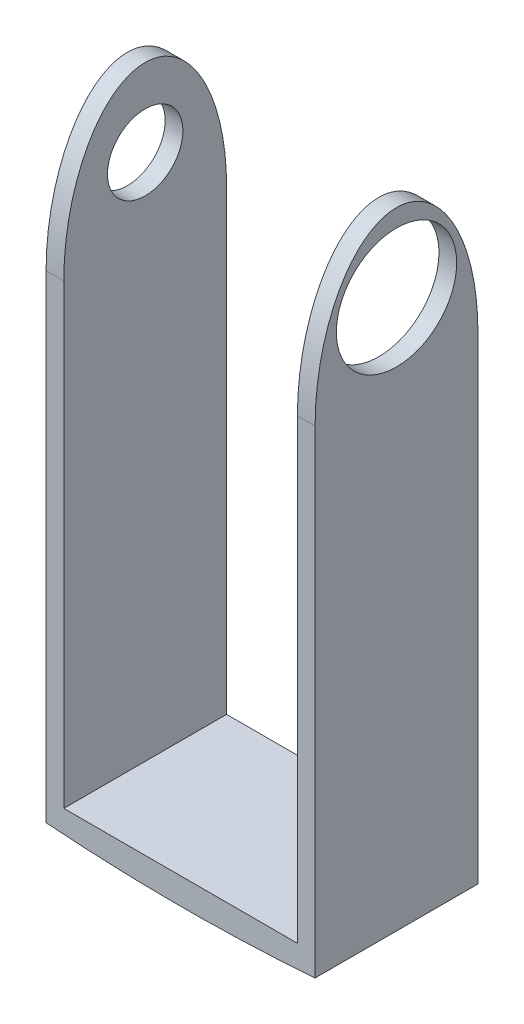
ISO-10303-21;
HEADER;
FILE_DESCRIPTION(('STEP AP214'),'2;1');
FILE_NAME('part.step','',(''),(''),'','','');
FILE_SCHEMA(('AUTOMOTIVE_DESIGN { 1 0 10303 214 1 1 1 1 }'));
ENDSEC;
DATA;
#1=APPLICATION_CONTEXT('core data for automotive mechanical design processes');
#2=APPLICATION_PROTOCOL_DEFINITION('international standard','automotive_design',2000,#1);
#3=PRODUCT_CONTEXT('',#1,'mechanical');
#4=PRODUCT('Part','Part','',(#3));
#5=PRODUCT_RELATED_PRODUCT_CATEGORY('part','',(#4));
#6=PRODUCT_DEFINITION_FORMATION('','',#4);
#7=PRODUCT_DEFINITION_CONTEXT('part definition',#1,'design');
#8=PRODUCT_DEFINITION('design','',#6,#7);
#9=PRODUCT_DEFINITION_SHAPE('','',#8);
#10=(LENGTH_UNIT() NAMED_UNIT(*) SI_UNIT(.MILLI.,.METRE.));
#11=(NAMED_UNIT(*) PLANE_ANGLE_UNIT() SI_UNIT($,.RADIAN.));
#12=(NAMED_UNIT(*) SI_UNIT($,.STERADIAN.) SOLID_ANGLE_UNIT());
#13=UNCERTAINTY_MEASURE_WITH_UNIT(LENGTH_MEASURE(1.E-05),#10,'distance_accuracy_value','');
#14=(GEOMETRIC_REPRESENTATION_CONTEXT(3) GLOBAL_UNCERTAINTY_ASSIGNED_CONTEXT((#13)) GLOBAL_UNIT_ASSIGNED_CONTEXT((#10,
#11,#12)) REPRESENTATION_CONTEXT('',''));
#15=CARTESIAN_POINT('',(0.,0.,0.));
#16=DIRECTION('',(0.,0.,1.));
#17=DIRECTION('',(1.,0.,0.));
#18=AXIS2_PLACEMENT_3D('',#15,#16,#17);
#19=CARTESIAN_POINT('',(-3.35387323943662,20.1871866197183,5.842));
#20=DIRECTION('',(1.,0.,0.));
#21=DIRECTION('',(0.,1.,0.));
#22=AXIS2_PLACEMENT_3D('',#19,#20,#21);
#23=PLANE('',#22);
#24=CARTESIAN_POINT('',(-3.35387323943662,17.3931866197183,2.921));
#25=DIRECTION('',(-1.,0.,0.));
#26=DIRECTION('',(0.,0.,1.));
#27=AXIS2_PLACEMENT_3D('',#24,#25,#26);
#28=CIRCLE('',#27,1.35254999999999);
#29=CARTESIAN_POINT('',(-3.35387323943662,17.3931866197183,4.27354999999999));
#30=VERTEX_POINT('',#29);
#31=EDGE_CURVE('E127',#30,#30,#28,.T.);
#32=ORIENTED_EDGE('',*,*,#31,.F.);
#33=EDGE_LOOP('',(#32));
#34=FACE_BOUND('',#33,.T.);
#35=CARTESIAN_POINT('',(-3.35387323943662,14.8605576724728,2.921));
#36=DIRECTION('',(1.,0.,0.));
#37=DIRECTION('',(0.,1.,0.));
#38=AXIS2_PLACEMENT_3D('',#35,#36,#37);
#39=ELLIPSE('',#38,5.32662894724555,2.921);
#40=CARTESIAN_POINT('',(-3.35387323943662,14.8605576724728,0.));
#41=VERTEX_POINT('',#40);
#42=CARTESIAN_POINT('',(-3.35387323943662,14.8605576724728,5.842));
#43=VERTEX_POINT('',#42);
#44=EDGE_CURVE('E58',#41,#43,#39,.T.);
#45=ORIENTED_EDGE('',*,*,#44,.F.);
#46=DIRECTION('',(0.,-1.,0.));
#47=VECTOR('',#46,1.);
#48=CARTESIAN_POINT('',(-3.35387323943662,20.1871866197183,0.));
#49=LINE('',#48,#47);
#50=CARTESIAN_POINT('',(-3.35387323943662,-2.29181338028169,0.));
#51=VERTEX_POINT('',#50);
#52=EDGE_CURVE('E101',#41,#51,#49,.T.);
#53=ORIENTED_EDGE('',*,*,#52,.T.);
#54=DIRECTION('',(0.,0.,-1.));
#55=VECTOR('',#54,1.);
#56=CARTESIAN_POINT('',(-3.35387323943662,-2.29181338028169,5.842));
#57=LINE('',#56,#55);
#58=CARTESIAN_POINT('',(-3.35387323943662,-2.29181338028169,5.842));
#59=VERTEX_POINT('',#58);
#60=EDGE_CURVE('E147',#59,#51,#57,.T.);
#61=ORIENTED_EDGE('',*,*,#60,.F.);
#62=DIRECTION('',(0.,-1.,0.));
#63=VECTOR('',#62,1.);
#64=CARTESIAN_POINT('',(-3.35387323943662,20.1871866197183,5.842));
#65=LINE('',#64,#63);
#66=EDGE_CURVE('E103',#43,#59,#65,.T.);
#67=ORIENTED_EDGE('',*,*,#66,.F.);
#68=EDGE_LOOP('',(#45,#53,#61,#67));
#69=FACE_BOUND('',#68,.T.);
#70=ADVANCED_FACE('F36',(#34,#69),#23,.F.);
#71=CARTESIAN_POINT('',(6.29812676056338,-2.29181338028169,5.842));
#72=DIRECTION('',(-1.,0.,0.));
#73=DIRECTION('',(0.,-1.,0.));
#74=AXIS2_PLACEMENT_3D('',#71,#72,#73);
#75=PLANE('',#74);
#76=CARTESIAN_POINT('',(6.29812676056338,17.3931866197183,2.921));
#77=DIRECTION('',(1.,0.,0.));
#78=DIRECTION('',(0.,0.,-1.));
#79=AXIS2_PLACEMENT_3D('',#76,#77,#78);
#80=CIRCLE('',#79,2.159);
#81=CARTESIAN_POINT('',(6.29812676056338,17.3931866197183,0.762000000000001));
#82=VERTEX_POINT('',#81);
#83=EDGE_CURVE('E182',#82,#82,#80,.T.);
#84=ORIENTED_EDGE('',*,*,#83,.F.);
#85=EDGE_LOOP('',(#84));
#86=FACE_BOUND('',#85,.T.);
#87=DIRECTION('',(0.,1.,0.));
#88=VECTOR('',#87,1.);
#89=CARTESIAN_POINT('',(6.29812676056338,-2.29181338028169,0.));
#90=LINE('',#89,#88);
#91=CARTESIAN_POINT('',(6.29812676056333,-2.29181338028169,0.));
#92=VERTEX_POINT('',#91);
#93=CARTESIAN_POINT('',(6.29812676056338,14.8605576724728,0.));
#94=VERTEX_POINT('',#93);
#95=EDGE_CURVE('E120',#92,#94,#90,.T.);
#96=ORIENTED_EDGE('',*,*,#95,.T.);
#97=CARTESIAN_POINT('',(6.29812676056338,14.8605576724728,2.921));
#98=DIRECTION('',(1.,0.,0.));
#99=DIRECTION('',(0.,1.,0.));
#100=AXIS2_PLACEMENT_3D('',#97,#98,#99);
#101=ELLIPSE('',#100,5.32662894724555,2.921);
#102=CARTESIAN_POINT('',(6.29812676056338,14.8605576724728,5.842));
#103=VERTEX_POINT('',#102);
#104=EDGE_CURVE('E105',#94,#103,#101,.T.);
#105=ORIENTED_EDGE('',*,*,#104,.T.);
#106=DIRECTION('',(0.,1.,0.));
#107=VECTOR('',#106,1.);
#108=CARTESIAN_POINT('',(6.29812676056338,-2.29181338028169,5.842));
#109=LINE('',#108,#107);
#110=CARTESIAN_POINT('',(6.29812676056338,-2.29181338028169,5.842));
#111=VERTEX_POINT('',#110);
#112=EDGE_CURVE('E155',#111,#103,#109,.T.);
#113=ORIENTED_EDGE('',*,*,#112,.F.);
#114=DIRECTION('',(0.,0.,-1.));
#115=VECTOR('',#114,1.);
#116=CARTESIAN_POINT('',(6.29812676056338,-2.29181338028169,5.842));
#117=LINE('',#116,#115);
#118=EDGE_CURVE('E144',#111,#92,#117,.T.);
#119=ORIENTED_EDGE('',*,*,#118,.T.);
#120=EDGE_LOOP('',(#96,#105,#113,#119));
#121=FACE_BOUND('',#120,.T.);
#122=ADVANCED_FACE('F154',(#86,#121),#75,.F.);
#123=CARTESIAN_POINT('',(5.66312676056338,20.1871866197183,5.842));
#124=DIRECTION('',(1.,0.,0.));
#125=DIRECTION('',(0.,1.,0.));
#126=AXIS2_PLACEMENT_3D('',#123,#124,#125);
#127=PLANE('',#126);
#128=CARTESIAN_POINT('',(5.66312676056338,17.3931866197183,2.921));
#129=DIRECTION('',(1.,0.,0.));
#130=DIRECTION('',(0.,1.,0.));
#131=AXIS2_PLACEMENT_3D('',#128,#129,#130);
#132=CIRCLE('',#131,2.159);
#133=CARTESIAN_POINT('',(5.66312676056338,19.5521866197183,2.921));
#134=VERTEX_POINT('',#133);
#135=EDGE_CURVE('E178',#134,#134,#132,.F.);
#136=ORIENTED_EDGE('',*,*,#135,.F.);
#137=EDGE_LOOP('',(#136));
#138=FACE_BOUND('',#137,.T.);
#139=CARTESIAN_POINT('',(5.66312676056338,14.8605576724728,2.921));
#140=DIRECTION('',(1.,0.,0.));
#141=DIRECTION('',(0.,1.,0.));
#142=AXIS2_PLACEMENT_3D('',#139,#140,#141);
#143=ELLIPSE('',#142,5.32662894724555,2.921);
#144=CARTESIAN_POINT('',(5.66312676056338,14.8605576724728,0.));
#145=VERTEX_POINT('',#144);
#146=CARTESIAN_POINT('',(5.66312676056338,14.8605576724728,5.842));
#147=VERTEX_POINT('',#146);
#148=EDGE_CURVE('E50',#145,#147,#143,.T.);
#149=ORIENTED_EDGE('',*,*,#148,.F.);
#150=DIRECTION('',(0.,-1.,0.));
#151=VECTOR('',#150,1.);
#152=CARTESIAN_POINT('',(5.66312676056338,20.1871866197183,0.));
#153=LINE('',#152,#151);
#154=CARTESIAN_POINT('',(5.66312676056338,-1.52981338028169,0.));
#155=VERTEX_POINT('',#154);
#156=EDGE_CURVE('E124',#145,#155,#153,.T.);
#157=ORIENTED_EDGE('',*,*,#156,.T.);
#158=DIRECTION('',(0.,0.,-1.));
#159=VECTOR('',#158,1.);
#160=CARTESIAN_POINT('',(5.66312676056338,-1.52981338028169,5.842));
#161=LINE('',#160,#159);
#162=CARTESIAN_POINT('',(5.66312676056338,-1.52981338028169,5.842));
#163=VERTEX_POINT('',#162);
#164=EDGE_CURVE('E141',#163,#155,#161,.T.);
#165=ORIENTED_EDGE('',*,*,#164,.F.);
#166=DIRECTION('',(0.,-1.,0.));
#167=VECTOR('',#166,1.);
#168=CARTESIAN_POINT('',(5.66312676056338,20.1871866197183,5.842));
#169=LINE('',#168,#167);
#170=EDGE_CURVE('E162',#147,#163,#169,.T.);
#171=ORIENTED_EDGE('',*,*,#170,.F.);
#172=EDGE_LOOP('',(#149,#157,#165,#171));
#173=FACE_BOUND('',#172,.T.);
#174=ADVANCED_FACE('F194',(#138,#173),#127,.F.);
#175=CARTESIAN_POINT('',(-2.71887323943662,-1.52981338028169,5.842));
#176=DIRECTION('',(-1.,0.,0.));
#177=DIRECTION('',(0.,-1.,0.));
#178=AXIS2_PLACEMENT_3D('',#175,#176,#177);
#179=PLANE('',#178);
#180=CARTESIAN_POINT('',(-2.71887323943662,17.3931866197183,2.921));
#181=DIRECTION('',(-1.,0.,0.));
#182=DIRECTION('',(0.,-1.,0.));
#183=AXIS2_PLACEMENT_3D('',#180,#181,#182);
#184=CIRCLE('',#183,1.35254999999999);
#185=CARTESIAN_POINT('',(-2.71887323943662,16.0406366197183,2.921));
#186=VERTEX_POINT('',#185);
#187=EDGE_CURVE('E121',#186,#186,#184,.T.);
#188=ORIENTED_EDGE('',*,*,#187,.T.);
#189=EDGE_LOOP('',(#188));
#190=FACE_BOUND('',#189,.T.);
#191=DIRECTION('',(0.,1.,0.));
#192=VECTOR('',#191,1.);
#193=CARTESIAN_POINT('',(-2.71887323943662,-1.52981338028169,0.));
#194=LINE('',#193,#192);
#195=CARTESIAN_POINT('',(-2.71887323943662,-1.52981338028169,0.));
#196=VERTEX_POINT('',#195);
#197=CARTESIAN_POINT('',(-2.71887323943662,14.8605576724728,0.));
#198=VERTEX_POINT('',#197);
#199=EDGE_CURVE('E136',#196,#198,#194,.T.);
#200=ORIENTED_EDGE('',*,*,#199,.T.);
#201=CARTESIAN_POINT('',(-2.71887323943662,14.8605576724728,2.921));
#202=DIRECTION('',(1.,0.,0.));
#203=DIRECTION('',(0.,1.,0.));
#204=AXIS2_PLACEMENT_3D('',#201,#202,#203);
#205=ELLIPSE('',#204,5.32662894724555,2.921);
#206=CARTESIAN_POINT('',(-2.71887323943662,14.8605576724728,5.842));
#207=VERTEX_POINT('',#206);
#208=EDGE_CURVE('E111',#207,#198,#205,.F.);
#209=ORIENTED_EDGE('',*,*,#208,.F.);
#210=DIRECTION('',(0.,1.,0.));
#211=VECTOR('',#210,1.);
#212=CARTESIAN_POINT('',(-2.71887323943662,-1.52981338028169,5.842));
#213=LINE('',#212,#211);
#214=CARTESIAN_POINT('',(-2.71887323943662,-1.52981338028169,5.842));
#215=VERTEX_POINT('',#214);
#216=EDGE_CURVE('E130',#215,#207,#213,.T.);
#217=ORIENTED_EDGE('',*,*,#216,.F.);
#218=DIRECTION('',(0.,0.,-1.));
#219=VECTOR('',#218,1.);
#220=CARTESIAN_POINT('',(-2.71887323943662,-1.52981338028169,5.842));
#221=LINE('',#220,#219);
#222=EDGE_CURVE('E138',#215,#196,#221,.T.);
#223=ORIENTED_EDGE('',*,*,#222,.T.);
#224=EDGE_LOOP('',(#200,#209,#217,#223));
#225=FACE_BOUND('',#224,.T.);
#226=ADVANCED_FACE('F172',(#190,#225),#179,.F.);
#227=CARTESIAN_POINT('',(5.66312676056338,-1.52981338028169,5.842));
#228=DIRECTION('',(0.,-1.,0.));
#229=DIRECTION('',(1.,0.,0.));
#230=AXIS2_PLACEMENT_3D('',#227,#228,#229);
#231=PLANE('',#230);
#232=DIRECTION('',(-1.,0.,0.));
#233=VECTOR('',#232,1.);
#234=CARTESIAN_POINT('',(5.66312676056338,-1.52981338028169,0.));
#235=LINE('',#234,#233);
#236=EDGE_CURVE('E134',#155,#196,#235,.T.);
#237=ORIENTED_EDGE('',*,*,#236,.T.);
#238=ORIENTED_EDGE('',*,*,#222,.F.);
#239=DIRECTION('',(-1.,0.,0.));
#240=VECTOR('',#239,1.);
#241=CARTESIAN_POINT('',(5.66312676056338,-1.52981338028169,5.842));
#242=LINE('',#241,#240);
#243=EDGE_CURVE('E164',#163,#215,#242,.T.);
#244=ORIENTED_EDGE('',*,*,#243,.F.);
#245=ORIENTED_EDGE('',*,*,#164,.T.);
#246=EDGE_LOOP('',(#237,#238,#244,#245));
#247=FACE_BOUND('',#246,.T.);
#248=ADVANCED_FACE('F203',(#247),#231,.F.);
#249=CARTESIAN_POINT('',(0.,0.,5.842));
#250=DIRECTION('',(0.,0.,1.));
#251=DIRECTION('',(1.,0.,0.));
#252=AXIS2_PLACEMENT_3D('',#249,#250,#251);
#253=PLANE('',#252);
#254=DIRECTION('',(1.,0.,0.));
#255=VECTOR('',#254,1.);
#256=CARTESIAN_POINT('',(-3.35387323943662,14.8605576724728,5.842));
#257=LINE('',#256,#255);
#258=EDGE_CURVE('E104',#43,#207,#257,.T.);
#259=ORIENTED_EDGE('',*,*,#258,.F.);
#260=ORIENTED_EDGE('',*,*,#66,.T.);
#261=CARTESIAN_POINT('',(1.47212676056338,60.260295840751,5.842));
#262=DIRECTION('',(0.,0.,1.));
#263=DIRECTION('',(1.,0.,0.));
#264=AXIS2_PLACEMENT_3D('',#261,#262,#263);
#265=CIRCLE('',#264,62.738);
#266=EDGE_CURVE('E160',#59,#111,#265,.T.);
#267=ORIENTED_EDGE('',*,*,#266,.T.);
#268=ORIENTED_EDGE('',*,*,#112,.T.);
#269=DIRECTION('',(1.,0.,0.));
#270=VECTOR('',#269,1.);
#271=CARTESIAN_POINT('',(-3.35387323943662,14.8605576724728,5.842));
#272=LINE('',#271,#270);
#273=EDGE_CURVE('E43',#147,#103,#272,.T.);
#274=ORIENTED_EDGE('',*,*,#273,.F.);
#275=ORIENTED_EDGE('',*,*,#170,.T.);
#276=ORIENTED_EDGE('',*,*,#243,.T.);
#277=ORIENTED_EDGE('',*,*,#216,.T.);
#278=EDGE_LOOP('',(#259,#260,#267,#268,#274,#275,#276,#277));
#279=FACE_BOUND('',#278,.T.);
#280=ADVANCED_FACE('F158',(#279),#253,.T.);
#281=CARTESIAN_POINT('',(0.,0.,0.));
#282=DIRECTION('',(0.,0.,1.));
#283=DIRECTION('',(1.,0.,0.));
#284=AXIS2_PLACEMENT_3D('',#281,#282,#283);
#285=PLANE('',#284);
#286=ORIENTED_EDGE('',*,*,#52,.F.);
#287=DIRECTION('',(1.,0.,0.));
#288=VECTOR('',#287,1.);
#289=CARTESIAN_POINT('',(-3.35387323943662,14.8605576724728,0.));
#290=LINE('',#289,#288);
#291=EDGE_CURVE('E108',#41,#198,#290,.T.);
#292=ORIENTED_EDGE('',*,*,#291,.T.);
#293=ORIENTED_EDGE('',*,*,#199,.F.);
#294=ORIENTED_EDGE('',*,*,#236,.F.);
#295=ORIENTED_EDGE('',*,*,#156,.F.);
#296=DIRECTION('',(1.,0.,0.));
#297=VECTOR('',#296,1.);
#298=CARTESIAN_POINT('',(-3.35387323943662,14.8605576724728,0.));
#299=LINE('',#298,#297);
#300=EDGE_CURVE('E11',#145,#94,#299,.T.);
#301=ORIENTED_EDGE('',*,*,#300,.T.);
#302=ORIENTED_EDGE('',*,*,#95,.F.);
#303=CARTESIAN_POINT('',(1.47212676056338,60.260295840751,0.));
#304=DIRECTION('',(0.,0.,1.));
#305=DIRECTION('',(1.,0.,0.));
#306=AXIS2_PLACEMENT_3D('',#303,#304,#305);
#307=CIRCLE('',#306,62.738);
#308=EDGE_CURVE('E119',#51,#92,#307,.T.);
#309=ORIENTED_EDGE('',*,*,#308,.F.);
#310=EDGE_LOOP('',(#286,#292,#293,#294,#295,#301,#302,#309));
#311=FACE_BOUND('',#310,.T.);
#312=ADVANCED_FACE('F117',(#311),#285,.F.);
#313=CARTESIAN_POINT('',(-3.35387323943662,17.3931866197183,2.921));
#314=DIRECTION('',(-1.,0.,0.));
#315=DIRECTION('',(0.,0.,1.));
#316=AXIS2_PLACEMENT_3D('',#313,#314,#315);
#317=CYLINDRICAL_SURFACE('',#316,1.35254999999999);
#318=ORIENTED_EDGE('',*,*,#187,.F.);
#319=EDGE_LOOP('',(#318));
#320=FACE_BOUND('',#319,.T.);
#321=ORIENTED_EDGE('',*,*,#31,.T.);
#322=EDGE_LOOP('',(#321));
#323=FACE_BOUND('',#322,.T.);
#324=ADVANCED_FACE('F188',(#320,#323),#317,.F.);
#325=CARTESIAN_POINT('',(-3.35487323943662,17.3931866197183,2.921));
#326=DIRECTION('',(1.,0.,0.));
#327=DIRECTION('',(0.,0.,-1.));
#328=AXIS2_PLACEMENT_3D('',#325,#326,#327);
#329=CYLINDRICAL_SURFACE('',#328,2.159);
#330=ORIENTED_EDGE('',*,*,#83,.T.);
#331=EDGE_LOOP('',(#330));
#332=FACE_BOUND('',#331,.T.);
#333=ORIENTED_EDGE('',*,*,#135,.T.);
#334=EDGE_LOOP('',(#333));
#335=FACE_BOUND('',#334,.T.);
#336=ADVANCED_FACE('F216',(#332,#335),#329,.F.);
#337=CARTESIAN_POINT('',(1.47212676056338,60.260295840751,5.842));
#338=DIRECTION('',(0.,0.,-1.));
#339=DIRECTION('',(-1.,0.,0.));
#340=AXIS2_PLACEMENT_3D('',#337,#338,#339);
#341=CYLINDRICAL_SURFACE('',#340,62.738);
#342=ORIENTED_EDGE('',*,*,#308,.T.);
#343=ORIENTED_EDGE('',*,*,#118,.F.);
#344=ORIENTED_EDGE('',*,*,#266,.F.);
#345=ORIENTED_EDGE('',*,*,#60,.T.);
#346=EDGE_LOOP('',(#342,#343,#344,#345));
#347=FACE_BOUND('',#346,.T.);
#348=ADVANCED_FACE('F220',(#347),#341,.T.);
#349=DIRECTION('',(1.,0.,0.));
#350=VECTOR('',#349,1.);
#351=SURFACE_OF_LINEAR_EXTRUSION('',#39,#350);
#352=ORIENTED_EDGE('',*,*,#148,.T.);
#353=ORIENTED_EDGE('',*,*,#273,.T.);
#354=ORIENTED_EDGE('',*,*,#104,.F.);
#355=ORIENTED_EDGE('',*,*,#300,.F.);
#356=EDGE_LOOP('',(#352,#353,#354,#355));
#357=FACE_BOUND('',#356,.T.);
#358=ADVANCED_FACE('F149',(#357),#351,.T.);
#359=ORIENTED_EDGE('',*,*,#208,.T.);
#360=ORIENTED_EDGE('',*,*,#291,.F.);
#361=ORIENTED_EDGE('',*,*,#44,.T.);
#362=ORIENTED_EDGE('',*,*,#258,.T.);
#363=EDGE_LOOP('',(#359,#360,#361,#362));
#364=FACE_BOUND('',#363,.T.);
#365=ADVANCED_FACE('F109',(#364),#351,.T.);
#366=CLOSED_SHELL('',(#70,#122,#174,#226,#248,#280,#312,#324,#336,#348,#358,#365));
#367=MANIFOLD_SOLID_BREP('B2',#366);
#368=ADVANCED_BREP_SHAPE_REPRESENTATION('',(#18,#367),#14);
#369=SHAPE_DEFINITION_REPRESENTATION(#9,#368);
ENDSEC;
END-ISO-10303-21;
